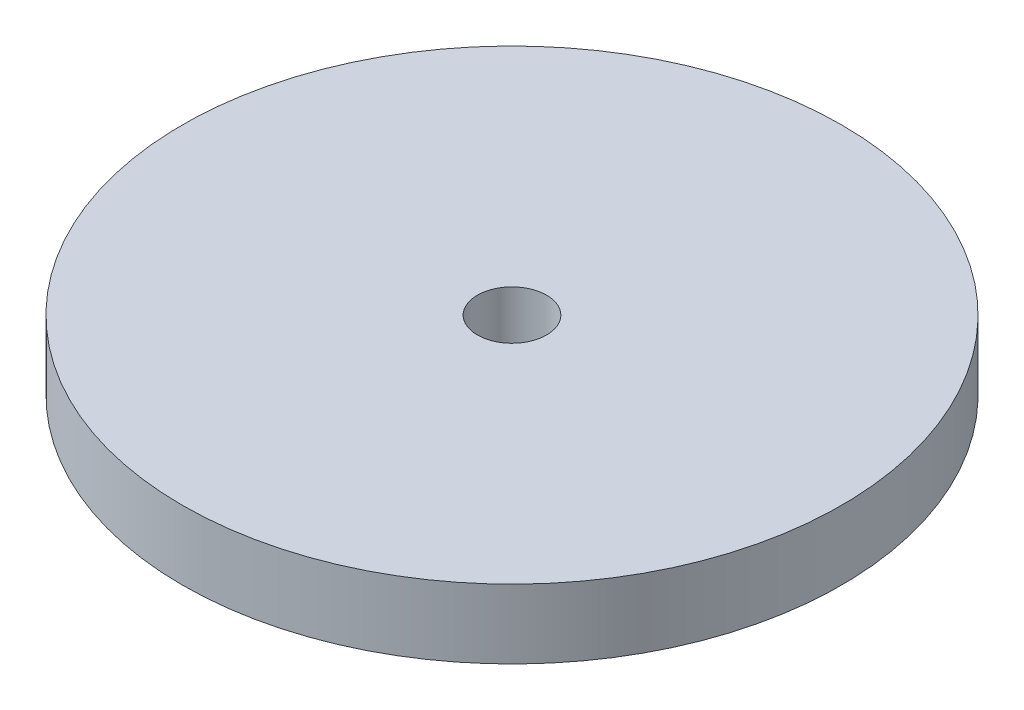
ISO-10303-21;
HEADER;
FILE_DESCRIPTION(('STEP AP214'),'2;1');
FILE_NAME('part.step','',(''),(''),'','','');
FILE_SCHEMA(('AUTOMOTIVE_DESIGN { 1 0 10303 214 1 1 1 1 }'));
ENDSEC;
DATA;
#1=APPLICATION_CONTEXT('core data for automotive mechanical design processes');
#2=APPLICATION_PROTOCOL_DEFINITION('international standard','automotive_design',2000,#1);
#3=PRODUCT_CONTEXT('',#1,'mechanical');
#4=PRODUCT('Part','Part','',(#3));
#5=PRODUCT_RELATED_PRODUCT_CATEGORY('part','',(#4));
#6=PRODUCT_DEFINITION_FORMATION('','',#4);
#7=PRODUCT_DEFINITION_CONTEXT('part definition',#1,'design');
#8=PRODUCT_DEFINITION('design','',#6,#7);
#9=PRODUCT_DEFINITION_SHAPE('','',#8);
#10=(LENGTH_UNIT() NAMED_UNIT(*) SI_UNIT(.MILLI.,.METRE.));
#11=(NAMED_UNIT(*) PLANE_ANGLE_UNIT() SI_UNIT($,.RADIAN.));
#12=(NAMED_UNIT(*) SI_UNIT($,.STERADIAN.) SOLID_ANGLE_UNIT());
#13=UNCERTAINTY_MEASURE_WITH_UNIT(LENGTH_MEASURE(1.E-05),#10,'distance_accuracy_value','');
#14=(GEOMETRIC_REPRESENTATION_CONTEXT(3) GLOBAL_UNCERTAINTY_ASSIGNED_CONTEXT((#13)) GLOBAL_UNIT_ASSIGNED_CONTEXT((#10,
#11,#12)) REPRESENTATION_CONTEXT('',''));
#15=CARTESIAN_POINT('',(0.,0.,0.));
#16=DIRECTION('',(0.,0.,1.));
#17=DIRECTION('',(1.,0.,0.));
#18=AXIS2_PLACEMENT_3D('',#15,#16,#17);
#19=CARTESIAN_POINT('',(0.,3.,0.));
#20=DIRECTION('',(0.,1.,0.));
#21=DIRECTION('',(0.,0.,1.));
#22=AXIS2_PLACEMENT_3D('',#19,#20,#21);
#23=PLANE('',#22);
#24=CARTESIAN_POINT('',(0.,3.,0.));
#25=DIRECTION('',(0.,1.,0.));
#26=DIRECTION('',(0.,0.,1.));
#27=AXIS2_PLACEMENT_3D('',#24,#25,#26);
#28=CIRCLE('',#27,14.3);
#29=CARTESIAN_POINT('',(0.,3.,14.3));
#30=VERTEX_POINT('',#29);
#31=EDGE_CURVE('E10',#30,#30,#28,.T.);
#32=ORIENTED_EDGE('',*,*,#31,.T.);
#33=EDGE_LOOP('',(#32));
#34=FACE_BOUND('',#33,.T.);
#35=CARTESIAN_POINT('',(0.,3.,0.));
#36=DIRECTION('',(0.,1.,0.));
#37=DIRECTION('',(0.,0.,1.));
#38=AXIS2_PLACEMENT_3D('',#35,#36,#37);
#39=CIRCLE('',#38,1.5);
#40=CARTESIAN_POINT('',(0.,3.,1.5));
#41=VERTEX_POINT('',#40);
#42=EDGE_CURVE('E42',#41,#41,#39,.T.);
#43=ORIENTED_EDGE('',*,*,#42,.F.);
#44=EDGE_LOOP('',(#43));
#45=FACE_BOUND('',#44,.T.);
#46=ADVANCED_FACE('F31',(#34,#45),#23,.T.);
#47=CARTESIAN_POINT('',(0.,0.,0.));
#48=DIRECTION('',(0.,1.,0.));
#49=DIRECTION('',(0.,0.,1.));
#50=AXIS2_PLACEMENT_3D('',#47,#48,#49);
#51=PLANE('',#50);
#52=CARTESIAN_POINT('',(0.,0.,0.));
#53=DIRECTION('',(0.,1.,0.));
#54=DIRECTION('',(0.,0.,1.));
#55=AXIS2_PLACEMENT_3D('',#52,#53,#54);
#56=CIRCLE('',#55,14.3);
#57=CARTESIAN_POINT('',(0.,0.,14.3));
#58=VERTEX_POINT('',#57);
#59=EDGE_CURVE('E35',#58,#58,#56,.T.);
#60=ORIENTED_EDGE('',*,*,#59,.F.);
#61=EDGE_LOOP('',(#60));
#62=FACE_BOUND('',#61,.T.);
#63=CARTESIAN_POINT('',(0.,0.,0.));
#64=DIRECTION('',(0.,1.,0.));
#65=DIRECTION('',(0.,0.,1.));
#66=AXIS2_PLACEMENT_3D('',#63,#64,#65);
#67=CIRCLE('',#66,1.5);
#68=CARTESIAN_POINT('',(0.,0.,1.5));
#69=VERTEX_POINT('',#68);
#70=EDGE_CURVE('E44',#69,#69,#67,.T.);
#71=ORIENTED_EDGE('',*,*,#70,.T.);
#72=EDGE_LOOP('',(#71));
#73=FACE_BOUND('',#72,.T.);
#74=ADVANCED_FACE('F54',(#62,#73),#51,.F.);
#75=CARTESIAN_POINT('',(0.,3.,0.));
#76=DIRECTION('',(0.,-1.,0.));
#77=DIRECTION('',(0.,0.,-1.));
#78=AXIS2_PLACEMENT_3D('',#75,#76,#77);
#79=CYLINDRICAL_SURFACE('',#78,14.3);
#80=ORIENTED_EDGE('',*,*,#31,.F.);
#81=EDGE_LOOP('',(#80));
#82=FACE_BOUND('',#81,.T.);
#83=ORIENTED_EDGE('',*,*,#59,.T.);
#84=EDGE_LOOP('',(#83));
#85=FACE_BOUND('',#84,.T.);
#86=ADVANCED_FACE('F33',(#82,#85),#79,.T.);
#87=CARTESIAN_POINT('',(0.,3.,0.));
#88=DIRECTION('',(0.,-1.,0.));
#89=DIRECTION('',(0.,0.,-1.));
#90=AXIS2_PLACEMENT_3D('',#87,#88,#89);
#91=CYLINDRICAL_SURFACE('',#90,1.5);
#92=ORIENTED_EDGE('',*,*,#42,.T.);
#93=EDGE_LOOP('',(#92));
#94=FACE_BOUND('',#93,.T.);
#95=ORIENTED_EDGE('',*,*,#70,.F.);
#96=EDGE_LOOP('',(#95));
#97=FACE_BOUND('',#96,.T.);
#98=ADVANCED_FACE('F50',(#94,#97),#91,.F.);
#99=CLOSED_SHELL('',(#46,#74,#86,#98));
#100=MANIFOLD_SOLID_BREP('B2',#99);
#101=ADVANCED_BREP_SHAPE_REPRESENTATION('',(#18,#100),#14);
#102=SHAPE_DEFINITION_REPRESENTATION(#9,#101);
ENDSEC;
END-ISO-10303-21;
